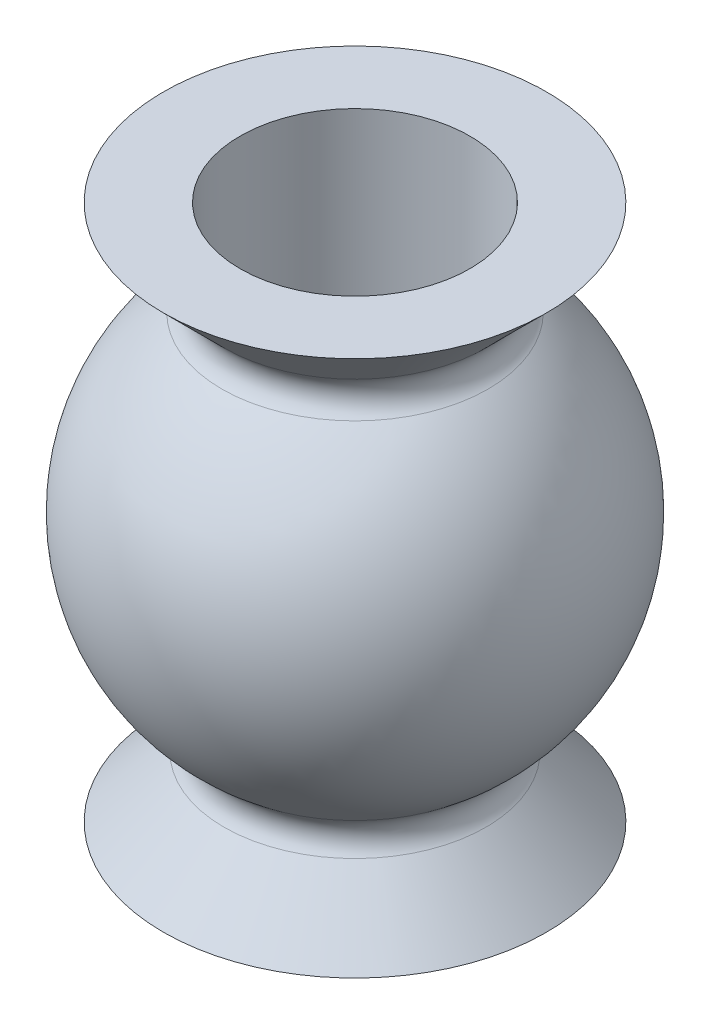
ISO-10303-21;
HEADER;
FILE_DESCRIPTION(('STEP AP214'),'2;1');
FILE_NAME('part.step','',(''),(''),'','','');
FILE_SCHEMA(('AUTOMOTIVE_DESIGN { 1 0 10303 214 1 1 1 1 }'));
ENDSEC;
DATA;
#1=APPLICATION_CONTEXT('core data for automotive mechanical design processes');
#2=APPLICATION_PROTOCOL_DEFINITION('international standard','automotive_design',2000,#1);
#3=PRODUCT_CONTEXT('',#1,'mechanical');
#4=PRODUCT('Part','Part','',(#3));
#5=PRODUCT_RELATED_PRODUCT_CATEGORY('part','',(#4));
#6=PRODUCT_DEFINITION_FORMATION('','',#4);
#7=PRODUCT_DEFINITION_CONTEXT('part definition',#1,'design');
#8=PRODUCT_DEFINITION('design','',#6,#7);
#9=PRODUCT_DEFINITION_SHAPE('','',#8);
#10=(LENGTH_UNIT() NAMED_UNIT(*) SI_UNIT(.MILLI.,.METRE.));
#11=(NAMED_UNIT(*) PLANE_ANGLE_UNIT() SI_UNIT($,.RADIAN.));
#12=(NAMED_UNIT(*) SI_UNIT($,.STERADIAN.) SOLID_ANGLE_UNIT());
#13=UNCERTAINTY_MEASURE_WITH_UNIT(LENGTH_MEASURE(1.E-05),#10,'distance_accuracy_value','');
#14=(GEOMETRIC_REPRESENTATION_CONTEXT(3) GLOBAL_UNCERTAINTY_ASSIGNED_CONTEXT((#13)) GLOBAL_UNIT_ASSIGNED_CONTEXT((#10,
#11,#12)) REPRESENTATION_CONTEXT('',''));
#15=CARTESIAN_POINT('',(0.,0.,0.));
#16=DIRECTION('',(0.,0.,1.));
#17=DIRECTION('',(1.,0.,0.));
#18=AXIS2_PLACEMENT_3D('',#15,#16,#17);
#19=CARTESIAN_POINT('',(0.,-2.49657392940562,0.));
#20=DIRECTION('',(0.,1.,0.));
#21=DIRECTION('',(0.,0.,1.));
#22=AXIS2_PLACEMENT_3D('',#19,#20,#21);
#23=TOROIDAL_SURFACE('',#22,1.92083799811754,0.3);
#24=CARTESIAN_POINT('',(0.,-2.70870596376158,0.));
#25=DIRECTION('',(0.,1.,0.));
#26=DIRECTION('',(0.,0.,1.));
#27=AXIS2_PLACEMENT_3D('',#24,#25,#26);
#28=CIRCLE('',#27,1.70870596376157);
#29=CARTESIAN_POINT('',(0.,-2.70870596376158,1.70870596376157));
#30=VERTEX_POINT('',#29);
#31=EDGE_CURVE('E62',#30,#30,#28,.T.);
#32=ORIENTED_EDGE('',*,*,#31,.T.);
#33=EDGE_LOOP('',(#32));
#34=FACE_BOUND('',#33,.T.);
#35=CARTESIAN_POINT('',(0.,-2.25880498374794,0.));
#36=DIRECTION('',(0.,1.,0.));
#37=DIRECTION('',(0.,0.,1.));
#38=AXIS2_PLACEMENT_3D('',#35,#36,#37);
#39=CIRCLE('',#38,1.73790104591587);
#40=CARTESIAN_POINT('',(0.,-2.25880498374794,1.73790104591587));
#41=VERTEX_POINT('',#40);
#42=EDGE_CURVE('E10',#41,#41,#39,.T.);
#43=ORIENTED_EDGE('',*,*,#42,.F.);
#44=EDGE_LOOP('',(#43));
#45=FACE_BOUND('',#44,.T.);
#46=ADVANCED_FACE('F34',(#34,#45),#23,.F.);
#47=CARTESIAN_POINT('',(0.,0.,0.));
#48=DIRECTION('',(0.,1.,0.));
#49=DIRECTION('',(0.,0.,-1.));
#50=AXIS2_PLACEMENT_3D('',#47,#48,#49);
#51=SPHERICAL_SURFACE('',#50,2.85);
#52=CARTESIAN_POINT('',(0.,2.25880498374793,0.));
#53=DIRECTION('',(0.,1.,0.));
#54=DIRECTION('',(0.,0.,1.));
#55=AXIS2_PLACEMENT_3D('',#52,#53,#54);
#56=CIRCLE('',#55,1.73790104591588);
#57=CARTESIAN_POINT('',(0.,2.25880498374793,1.73790104591588));
#58=VERTEX_POINT('',#57);
#59=EDGE_CURVE('E40',#58,#58,#56,.T.);
#60=ORIENTED_EDGE('',*,*,#59,.F.);
#61=EDGE_LOOP('',(#60));
#62=FACE_BOUND('',#61,.T.);
#63=ORIENTED_EDGE('',*,*,#42,.T.);
#64=EDGE_LOOP('',(#63));
#65=FACE_BOUND('',#64,.T.);
#66=ADVANCED_FACE('F98',(#62,#65),#51,.T.);
#67=CARTESIAN_POINT('',(0.,2.49657392940561,0.));
#68=DIRECTION('',(0.,1.,0.));
#69=DIRECTION('',(0.,0.,1.));
#70=AXIS2_PLACEMENT_3D('',#67,#68,#69);
#71=TOROIDAL_SURFACE('',#70,1.92083799811755,0.299999999999999);
#72=ORIENTED_EDGE('',*,*,#59,.T.);
#73=EDGE_LOOP('',(#72));
#74=FACE_BOUND('',#73,.T.);
#75=CARTESIAN_POINT('',(0.,2.70870596376157,0.));
#76=DIRECTION('',(0.,1.,0.));
#77=DIRECTION('',(0.,0.,1.));
#78=AXIS2_PLACEMENT_3D('',#75,#76,#77);
#79=CIRCLE('',#78,1.70870596376158);
#80=CARTESIAN_POINT('',(0.,2.70870596376157,1.70870596376158));
#81=VERTEX_POINT('',#80);
#82=EDGE_CURVE('E44',#81,#81,#79,.T.);
#83=ORIENTED_EDGE('',*,*,#82,.F.);
#84=EDGE_LOOP('',(#83));
#85=FACE_BOUND('',#84,.T.);
#86=ADVANCED_FACE('F94',(#74,#85),#71,.F.);
#87=CARTESIAN_POINT('',(0.,3.5,0.));
#88=DIRECTION('',(0.,1.,0.));
#89=DIRECTION('',(0.,0.,1.));
#90=AXIS2_PLACEMENT_3D('',#87,#88,#89);
#91=CONICAL_SURFACE('',#90,2.5,0.785398163397443);
#92=ORIENTED_EDGE('',*,*,#82,.T.);
#93=EDGE_LOOP('',(#92));
#94=FACE_BOUND('',#93,.T.);
#95=CARTESIAN_POINT('',(0.,3.5,0.));
#96=DIRECTION('',(0.,1.,0.));
#97=DIRECTION('',(0.,0.,1.));
#98=AXIS2_PLACEMENT_3D('',#95,#96,#97);
#99=CIRCLE('',#98,2.5);
#100=CARTESIAN_POINT('',(0.,3.5,2.5));
#101=VERTEX_POINT('',#100);
#102=EDGE_CURVE('E48',#101,#101,#99,.T.);
#103=ORIENTED_EDGE('',*,*,#102,.F.);
#104=EDGE_LOOP('',(#103));
#105=FACE_BOUND('',#104,.T.);
#106=ADVANCED_FACE('F88',(#94,#105),#91,.T.);
#107=CARTESIAN_POINT('',(0.,3.5,0.));
#108=DIRECTION('',(0.,1.,0.));
#109=DIRECTION('',(0.,0.,1.));
#110=AXIS2_PLACEMENT_3D('',#107,#108,#109);
#111=PLANE('',#110);
#112=ORIENTED_EDGE('',*,*,#102,.T.);
#113=EDGE_LOOP('',(#112));
#114=FACE_BOUND('',#113,.T.);
#115=CARTESIAN_POINT('',(0.,3.5,0.));
#116=DIRECTION('',(0.,1.,0.));
#117=DIRECTION('',(0.,0.,1.));
#118=AXIS2_PLACEMENT_3D('',#115,#116,#117);
#119=CIRCLE('',#118,1.5);
#120=CARTESIAN_POINT('',(0.,3.5,1.5));
#121=VERTEX_POINT('',#120);
#122=EDGE_CURVE('E53',#121,#121,#119,.T.);
#123=ORIENTED_EDGE('',*,*,#122,.F.);
#124=EDGE_LOOP('',(#123));
#125=FACE_BOUND('',#124,.T.);
#126=ADVANCED_FACE('F83',(#114,#125),#111,.T.);
#127=CARTESIAN_POINT('',(0.,0.,0.));
#128=DIRECTION('',(0.,1.,0.));
#129=DIRECTION('',(0.,0.,1.));
#130=AXIS2_PLACEMENT_3D('',#127,#128,#129);
#131=CYLINDRICAL_SURFACE('',#130,1.5);
#132=CARTESIAN_POINT('',(0.,-3.5,0.));
#133=DIRECTION('',(0.,1.,0.));
#134=DIRECTION('',(0.,0.,1.));
#135=AXIS2_PLACEMENT_3D('',#132,#133,#134);
#136=CIRCLE('',#135,1.5);
#137=CARTESIAN_POINT('',(0.,-3.5,1.5));
#138=VERTEX_POINT('',#137);
#139=EDGE_CURVE('E56',#138,#138,#136,.T.);
#140=ORIENTED_EDGE('',*,*,#139,.F.);
#141=EDGE_LOOP('',(#140));
#142=FACE_BOUND('',#141,.T.);
#143=ORIENTED_EDGE('',*,*,#122,.T.);
#144=EDGE_LOOP('',(#143));
#145=FACE_BOUND('',#144,.T.);
#146=ADVANCED_FACE('F77',(#142,#145),#131,.F.);
#147=CARTESIAN_POINT('',(0.,-3.5,0.));
#148=DIRECTION('',(0.,1.,0.));
#149=DIRECTION('',(0.,0.,1.));
#150=AXIS2_PLACEMENT_3D('',#147,#148,#149);
#151=PLANE('',#150);
#152=CARTESIAN_POINT('',(0.,-3.5,0.));
#153=DIRECTION('',(0.,1.,0.));
#154=DIRECTION('',(0.,0.,1.));
#155=AXIS2_PLACEMENT_3D('',#152,#153,#154);
#156=CIRCLE('',#155,2.5);
#157=CARTESIAN_POINT('',(0.,-3.5,2.5));
#158=VERTEX_POINT('',#157);
#159=EDGE_CURVE('E59',#158,#158,#156,.T.);
#160=ORIENTED_EDGE('',*,*,#159,.F.);
#161=EDGE_LOOP('',(#160));
#162=FACE_BOUND('',#161,.T.);
#163=ORIENTED_EDGE('',*,*,#139,.T.);
#164=EDGE_LOOP('',(#163));
#165=FACE_BOUND('',#164,.T.);
#166=ADVANCED_FACE('F71',(#162,#165),#151,.F.);
#167=CARTESIAN_POINT('',(0.,-3.5,0.));
#168=DIRECTION('',(0.,-1.,0.));
#169=DIRECTION('',(0.,0.,-1.));
#170=AXIS2_PLACEMENT_3D('',#167,#168,#169);
#171=CONICAL_SURFACE('',#170,2.5,0.785398163397454);
#172=ORIENTED_EDGE('',*,*,#31,.F.);
#173=EDGE_LOOP('',(#172));
#174=FACE_BOUND('',#173,.T.);
#175=ORIENTED_EDGE('',*,*,#159,.T.);
#176=EDGE_LOOP('',(#175));
#177=FACE_BOUND('',#176,.T.);
#178=ADVANCED_FACE('F68',(#174,#177),#171,.T.);
#179=CLOSED_SHELL('',(#46,#66,#86,#106,#126,#146,#166,#178));
#180=MANIFOLD_SOLID_BREP('B2',#179);
#181=ADVANCED_BREP_SHAPE_REPRESENTATION('',(#18,#180),#14);
#182=SHAPE_DEFINITION_REPRESENTATION(#9,#181);
ENDSEC;
END-ISO-10303-21;
